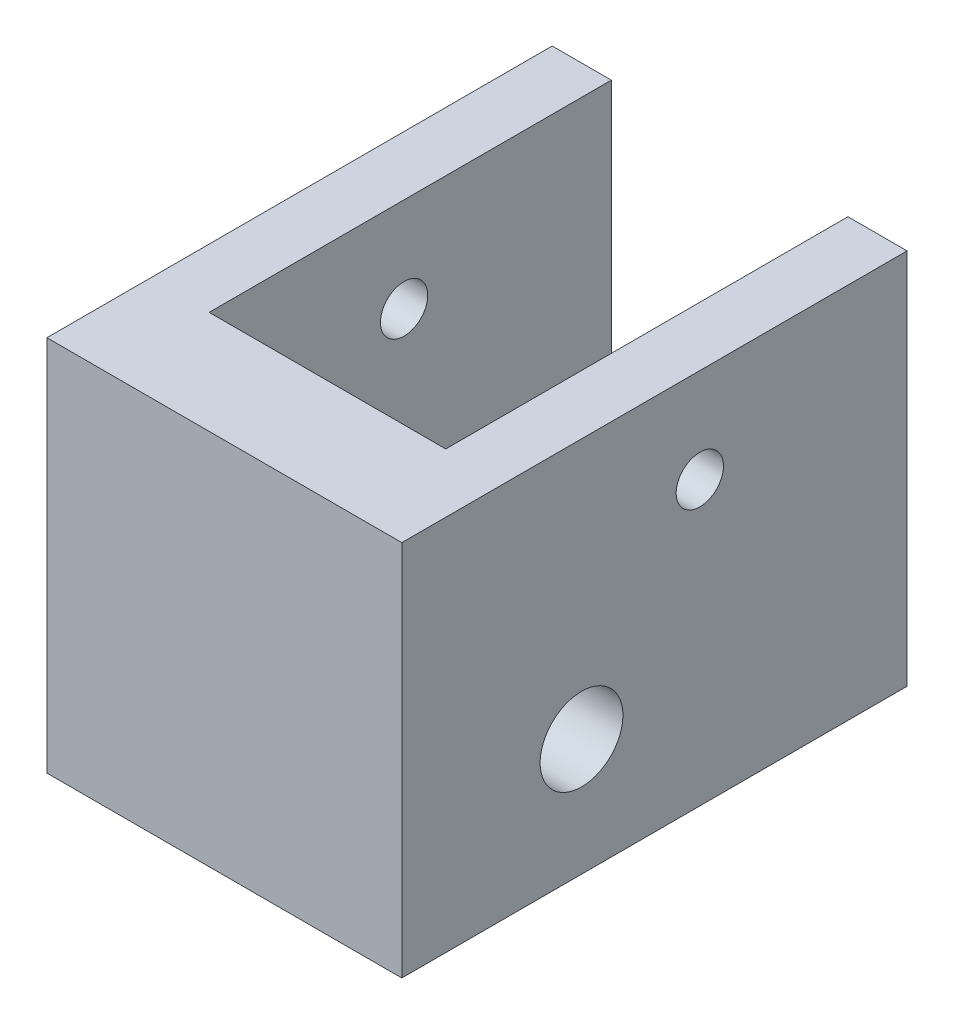
ISO-10303-21;
HEADER;
FILE_DESCRIPTION(('STEP AP214'),'2;1');
FILE_NAME('part.step','',(''),(''),'','','');
FILE_SCHEMA(('AUTOMOTIVE_DESIGN { 1 0 10303 214 1 1 1 1 }'));
ENDSEC;
DATA;
#1=APPLICATION_CONTEXT('core data for automotive mechanical design processes');
#2=APPLICATION_PROTOCOL_DEFINITION('international standard','automotive_design',2000,#1);
#3=PRODUCT_CONTEXT('',#1,'mechanical');
#4=PRODUCT('Part','Part','',(#3));
#5=PRODUCT_RELATED_PRODUCT_CATEGORY('part','',(#4));
#6=PRODUCT_DEFINITION_FORMATION('','',#4);
#7=PRODUCT_DEFINITION_CONTEXT('part definition',#1,'design');
#8=PRODUCT_DEFINITION('design','',#6,#7);
#9=PRODUCT_DEFINITION_SHAPE('','',#8);
#10=(LENGTH_UNIT() NAMED_UNIT(*) SI_UNIT(.MILLI.,.METRE.));
#11=(NAMED_UNIT(*) PLANE_ANGLE_UNIT() SI_UNIT($,.RADIAN.));
#12=(NAMED_UNIT(*) SI_UNIT($,.STERADIAN.) SOLID_ANGLE_UNIT());
#13=UNCERTAINTY_MEASURE_WITH_UNIT(LENGTH_MEASURE(1.E-05),#10,'distance_accuracy_value','');
#14=(GEOMETRIC_REPRESENTATION_CONTEXT(3) GLOBAL_UNCERTAINTY_ASSIGNED_CONTEXT((#13)) GLOBAL_UNIT_ASSIGNED_CONTEXT((#10,
#11,#12)) REPRESENTATION_CONTEXT('',''));
#15=CARTESIAN_POINT('',(0.,0.,0.));
#16=DIRECTION('',(0.,0.,1.));
#17=DIRECTION('',(1.,0.,0.));
#18=AXIS2_PLACEMENT_3D('',#15,#16,#17);
#19=CARTESIAN_POINT('',(15.,10.9905914643143,-13.7596180706659));
#20=DIRECTION('',(0.,0.,1.));
#21=DIRECTION('',(0.,-1.,0.));
#22=AXIS2_PLACEMENT_3D('',#19,#20,#21);
#23=PLANE('',#22);
#24=DIRECTION('',(-1.,0.,0.));
#25=VECTOR('',#24,1.);
#26=CARTESIAN_POINT('',(15.,10.9905914643143,-13.7596180706659));
#27=LINE('',#26,#25);
#28=CARTESIAN_POINT('',(2.5,10.9905914643143,-13.7596180706659));
#29=VERTEX_POINT('',#28);
#30=CARTESIAN_POINT('',(0.,10.9905914643143,-13.7596180706659));
#31=VERTEX_POINT('',#30);
#32=EDGE_CURVE('E45',#29,#31,#27,.T.);
#33=ORIENTED_EDGE('',*,*,#32,.F.);
#34=DIRECTION('',(0.,1.,0.));
#35=VECTOR('',#34,1.);
#36=CARTESIAN_POINT('',(2.5,-4.94780709576564,-13.7596180706659));
#37=LINE('',#36,#35);
#38=CARTESIAN_POINT('',(2.5,-4.94680709576564,-13.7596180706659));
#39=VERTEX_POINT('',#38);
#40=EDGE_CURVE('E129',#39,#29,#37,.T.);
#41=ORIENTED_EDGE('',*,*,#40,.F.);
#42=DIRECTION('',(-1.,0.,0.));
#43=VECTOR('',#42,1.);
#44=CARTESIAN_POINT('',(15.,-4.94680709576564,-13.7596180706659));
#45=LINE('',#44,#43);
#46=CARTESIAN_POINT('',(0.,-4.94680709576564,-13.7596180706659));
#47=VERTEX_POINT('',#46);
#48=EDGE_CURVE('E83',#39,#47,#45,.T.);
#49=ORIENTED_EDGE('',*,*,#48,.T.);
#50=DIRECTION('',(0.,1.,0.));
#51=VECTOR('',#50,1.);
#52=CARTESIAN_POINT('',(0.,10.9905914643143,-13.7596180706659));
#53=LINE('',#52,#51);
#54=EDGE_CURVE('E165',#47,#31,#53,.T.);
#55=ORIENTED_EDGE('',*,*,#54,.T.);
#56=EDGE_LOOP('',(#33,#41,#49,#55));
#57=FACE_BOUND('',#56,.T.);
#58=ADVANCED_FACE('F37',(#57),#23,.F.);
#59=CARTESIAN_POINT('',(15.,0.,0.));
#60=DIRECTION('',(-1.,0.,0.));
#61=DIRECTION('',(0.,0.,1.));
#62=AXIS2_PLACEMENT_3D('',#59,#60,#61);
#63=CYLINDRICAL_SURFACE('',#62,1.75);
#64=CARTESIAN_POINT('',(2.5,0.,0.));
#65=DIRECTION('',(-1.,0.,0.));
#66=DIRECTION('',(0.,0.,1.));
#67=AXIS2_PLACEMENT_3D('',#64,#65,#66);
#68=CIRCLE('',#67,1.75);
#69=CARTESIAN_POINT('',(2.5,0.,1.75));
#70=VERTEX_POINT('',#69);
#71=EDGE_CURVE('E142',#70,#70,#68,.F.);
#72=ORIENTED_EDGE('',*,*,#71,.T.);
#73=EDGE_LOOP('',(#72));
#74=FACE_BOUND('',#73,.T.);
#75=CARTESIAN_POINT('',(0.,0.,0.));
#76=DIRECTION('',(1.,0.,0.));
#77=DIRECTION('',(0.,0.,-1.));
#78=AXIS2_PLACEMENT_3D('',#75,#76,#77);
#79=CIRCLE('',#78,1.75);
#80=CARTESIAN_POINT('',(0.,0.,-1.75));
#81=VERTEX_POINT('',#80);
#82=EDGE_CURVE('E159',#81,#81,#79,.T.);
#83=ORIENTED_EDGE('',*,*,#82,.F.);
#84=EDGE_LOOP('',(#83));
#85=FACE_BOUND('',#84,.T.);
#86=ADVANCED_FACE('F200',(#74,#85),#63,.F.);
#87=CARTESIAN_POINT('',(15.,7.,-5.));
#88=DIRECTION('',(-1.,0.,0.));
#89=DIRECTION('',(0.,0.,1.));
#90=AXIS2_PLACEMENT_3D('',#87,#88,#89);
#91=CYLINDRICAL_SURFACE('',#90,1.);
#92=CARTESIAN_POINT('',(2.5,7.,-5.));
#93=DIRECTION('',(-1.,0.,0.));
#94=DIRECTION('',(0.,0.,1.));
#95=AXIS2_PLACEMENT_3D('',#92,#93,#94);
#96=CIRCLE('',#95,1.);
#97=CARTESIAN_POINT('',(2.5,7.,-4.));
#98=VERTEX_POINT('',#97);
#99=EDGE_CURVE('E135',#98,#98,#96,.F.);
#100=ORIENTED_EDGE('',*,*,#99,.T.);
#101=EDGE_LOOP('',(#100));
#102=FACE_BOUND('',#101,.T.);
#103=CARTESIAN_POINT('',(0.,7.,-5.));
#104=DIRECTION('',(1.,0.,0.));
#105=DIRECTION('',(0.,0.,-1.));
#106=AXIS2_PLACEMENT_3D('',#103,#104,#105);
#107=CIRCLE('',#106,1.);
#108=CARTESIAN_POINT('',(0.,7.,-6.));
#109=VERTEX_POINT('',#108);
#110=EDGE_CURVE('E128',#109,#109,#107,.T.);
#111=ORIENTED_EDGE('',*,*,#110,.F.);
#112=EDGE_LOOP('',(#111));
#113=FACE_BOUND('',#112,.T.);
#114=ADVANCED_FACE('F204',(#102,#113),#91,.F.);
#115=CARTESIAN_POINT('',(15.,0.,0.));
#116=DIRECTION('',(-1.,0.,0.));
#117=DIRECTION('',(0.,0.,1.));
#118=AXIS2_PLACEMENT_3D('',#115,#116,#117);
#119=PLANE('',#118);
#120=DIRECTION('',(0.,1.,0.));
#121=VECTOR('',#120,1.);
#122=CARTESIAN_POINT('',(15.,10.9905914643143,-13.7596180706659));
#123=LINE('',#122,#121);
#124=CARTESIAN_POINT('',(15.,-4.94680709576564,-13.7596180706659));
#125=VERTEX_POINT('',#124);
#126=CARTESIAN_POINT('',(15.,10.9905914643143,-13.7596180706659));
#127=VERTEX_POINT('',#126);
#128=EDGE_CURVE('E168',#125,#127,#123,.T.);
#129=ORIENTED_EDGE('',*,*,#128,.T.);
#130=DIRECTION('',(0.,0.,1.));
#131=VECTOR('',#130,1.);
#132=CARTESIAN_POINT('',(15.,10.9905914643143,-13.7596180706659));
#133=LINE('',#132,#131);
#134=CARTESIAN_POINT('',(15.,10.9905914643143,7.59707872008108));
#135=VERTEX_POINT('',#134);
#136=EDGE_CURVE('E90',#127,#135,#133,.T.);
#137=ORIENTED_EDGE('',*,*,#136,.T.);
#138=DIRECTION('',(0.,-1.,0.));
#139=VECTOR('',#138,1.);
#140=CARTESIAN_POINT('',(15.,10.9905914643143,7.59707872008108));
#141=LINE('',#140,#139);
#142=CARTESIAN_POINT('',(15.,-4.94680709576564,7.59707872008108));
#143=VERTEX_POINT('',#142);
#144=EDGE_CURVE('E172',#135,#143,#141,.T.);
#145=ORIENTED_EDGE('',*,*,#144,.T.);
#146=DIRECTION('',(0.,0.,-1.));
#147=VECTOR('',#146,1.);
#148=CARTESIAN_POINT('',(15.,-4.94680709576564,-13.7596180706659));
#149=LINE('',#148,#147);
#150=EDGE_CURVE('E61',#143,#125,#149,.T.);
#151=ORIENTED_EDGE('',*,*,#150,.T.);
#152=EDGE_LOOP('',(#129,#137,#145,#151));
#153=FACE_BOUND('',#152,.T.);
#154=CARTESIAN_POINT('',(15.,0.,0.));
#155=DIRECTION('',(1.,0.,0.));
#156=DIRECTION('',(0.,0.,-1.));
#157=AXIS2_PLACEMENT_3D('',#154,#155,#156);
#158=CIRCLE('',#157,1.75);
#159=CARTESIAN_POINT('',(15.,0.,-1.75));
#160=VERTEX_POINT('',#159);
#161=EDGE_CURVE('E162',#160,#160,#158,.T.);
#162=ORIENTED_EDGE('',*,*,#161,.F.);
#163=EDGE_LOOP('',(#162));
#164=FACE_BOUND('',#163,.T.);
#165=CARTESIAN_POINT('',(15.,7.,-5.));
#166=DIRECTION('',(1.,0.,0.));
#167=DIRECTION('',(0.,0.,-1.));
#168=AXIS2_PLACEMENT_3D('',#165,#166,#167);
#169=CIRCLE('',#168,1.);
#170=CARTESIAN_POINT('',(15.,7.,-6.));
#171=VERTEX_POINT('',#170);
#172=EDGE_CURVE('E156',#171,#171,#169,.T.);
#173=ORIENTED_EDGE('',*,*,#172,.F.);
#174=EDGE_LOOP('',(#173));
#175=FACE_BOUND('',#174,.T.);
#176=ADVANCED_FACE('F215',(#153,#164,#175),#119,.F.);
#177=CARTESIAN_POINT('',(0.,0.,0.));
#178=DIRECTION('',(-1.,0.,0.));
#179=DIRECTION('',(0.,0.,1.));
#180=AXIS2_PLACEMENT_3D('',#177,#178,#179);
#181=PLANE('',#180);
#182=ORIENTED_EDGE('',*,*,#82,.T.);
#183=EDGE_LOOP('',(#182));
#184=FACE_BOUND('',#183,.T.);
#185=ORIENTED_EDGE('',*,*,#54,.F.);
#186=DIRECTION('',(0.,0.,-1.));
#187=VECTOR('',#186,1.);
#188=CARTESIAN_POINT('',(0.,-4.94680709576564,-13.7596180706659));
#189=LINE('',#188,#187);
#190=CARTESIAN_POINT('',(0.,-4.94680709576564,7.59707872008108));
#191=VERTEX_POINT('',#190);
#192=EDGE_CURVE('E170',#191,#47,#189,.T.);
#193=ORIENTED_EDGE('',*,*,#192,.F.);
#194=DIRECTION('',(0.,-1.,0.));
#195=VECTOR('',#194,1.);
#196=CARTESIAN_POINT('',(0.,10.9905914643143,7.59707872008108));
#197=LINE('',#196,#195);
#198=CARTESIAN_POINT('',(0.,10.9905914643143,7.59707872008108));
#199=VERTEX_POINT('',#198);
#200=EDGE_CURVE('E178',#199,#191,#197,.T.);
#201=ORIENTED_EDGE('',*,*,#200,.F.);
#202=DIRECTION('',(0.,0.,1.));
#203=VECTOR('',#202,1.);
#204=CARTESIAN_POINT('',(0.,10.9905914643143,-13.7596180706659));
#205=LINE('',#204,#203);
#206=EDGE_CURVE('E176',#31,#199,#205,.T.);
#207=ORIENTED_EDGE('',*,*,#206,.F.);
#208=EDGE_LOOP('',(#185,#193,#201,#207));
#209=FACE_BOUND('',#208,.T.);
#210=ORIENTED_EDGE('',*,*,#110,.T.);
#211=EDGE_LOOP('',(#210));
#212=FACE_BOUND('',#211,.T.);
#213=ADVANCED_FACE('F196',(#184,#209,#212),#181,.T.);
#214=CARTESIAN_POINT('',(12.5,-4.94680709576564,-13.7596180706659));
#215=VERTEX_POINT('',#214);
#216=EDGE_CURVE('E181',#125,#215,#45,.T.);
#217=ORIENTED_EDGE('',*,*,#216,.T.);
#218=DIRECTION('',(0.,1.,0.));
#219=VECTOR('',#218,1.);
#220=CARTESIAN_POINT('',(12.5,-4.94780709576564,-13.7596180706659));
#221=LINE('',#220,#219);
#222=CARTESIAN_POINT('',(12.5,10.9905914643143,-13.7596180706659));
#223=VERTEX_POINT('',#222);
#224=EDGE_CURVE('E150',#215,#223,#221,.T.);
#225=ORIENTED_EDGE('',*,*,#224,.T.);
#226=EDGE_CURVE('E11',#127,#223,#27,.T.);
#227=ORIENTED_EDGE('',*,*,#226,.F.);
#228=ORIENTED_EDGE('',*,*,#128,.F.);
#229=EDGE_LOOP('',(#217,#225,#227,#228));
#230=FACE_BOUND('',#229,.T.);
#231=ADVANCED_FACE('F39',(#230),#23,.F.);
#232=CARTESIAN_POINT('',(15.,10.9905914643143,-13.7596180706659));
#233=DIRECTION('',(0.,-1.,0.));
#234=DIRECTION('',(0.,0.,-1.));
#235=AXIS2_PLACEMENT_3D('',#232,#233,#234);
#236=PLANE('',#235);
#237=DIRECTION('',(1.,0.,0.));
#238=VECTOR('',#237,1.);
#239=CARTESIAN_POINT('',(2.5,10.9905914643143,3.24038192933407));
#240=LINE('',#239,#238);
#241=CARTESIAN_POINT('',(2.5,10.9905914643143,3.24038192933407));
#242=VERTEX_POINT('',#241);
#243=CARTESIAN_POINT('',(12.5,10.9905914643143,3.24038192933407));
#244=VERTEX_POINT('',#243);
#245=EDGE_CURVE('E146',#242,#244,#240,.T.);
#246=ORIENTED_EDGE('',*,*,#245,.F.);
#247=DIRECTION('',(0.,0.,1.));
#248=VECTOR('',#247,1.);
#249=CARTESIAN_POINT('',(2.5,10.9905914643143,-13.7596180706659));
#250=LINE('',#249,#248);
#251=EDGE_CURVE('E117',#29,#242,#250,.T.);
#252=ORIENTED_EDGE('',*,*,#251,.F.);
#253=ORIENTED_EDGE('',*,*,#32,.T.);
#254=ORIENTED_EDGE('',*,*,#206,.T.);
#255=DIRECTION('',(-1.,0.,0.));
#256=VECTOR('',#255,1.);
#257=CARTESIAN_POINT('',(15.,10.9905914643143,7.59707872008108));
#258=LINE('',#257,#256);
#259=EDGE_CURVE('E186',#135,#199,#258,.T.);
#260=ORIENTED_EDGE('',*,*,#259,.F.);
#261=ORIENTED_EDGE('',*,*,#136,.F.);
#262=ORIENTED_EDGE('',*,*,#226,.T.);
#263=DIRECTION('',(0.,0.,-1.));
#264=VECTOR('',#263,1.);
#265=CARTESIAN_POINT('',(12.5,10.9905914643143,-13.7596180706659));
#266=LINE('',#265,#264);
#267=EDGE_CURVE('E122',#244,#223,#266,.T.);
#268=ORIENTED_EDGE('',*,*,#267,.F.);
#269=EDGE_LOOP('',(#246,#252,#253,#254,#260,#261,#262,#268));
#270=FACE_BOUND('',#269,.T.);
#271=ADVANCED_FACE('F193',(#270),#236,.F.);
#272=CARTESIAN_POINT('',(15.,10.9905914643143,7.59707872008108));
#273=DIRECTION('',(0.,0.,-1.));
#274=DIRECTION('',(-1.,0.,0.));
#275=AXIS2_PLACEMENT_3D('',#272,#273,#274);
#276=PLANE('',#275);
#277=ORIENTED_EDGE('',*,*,#200,.T.);
#278=DIRECTION('',(-1.,0.,0.));
#279=VECTOR('',#278,1.);
#280=CARTESIAN_POINT('',(15.,-4.94680709576564,7.59707872008108));
#281=LINE('',#280,#279);
#282=EDGE_CURVE('E184',#143,#191,#281,.T.);
#283=ORIENTED_EDGE('',*,*,#282,.F.);
#284=ORIENTED_EDGE('',*,*,#144,.F.);
#285=ORIENTED_EDGE('',*,*,#259,.T.);
#286=EDGE_LOOP('',(#277,#283,#284,#285));
#287=FACE_BOUND('',#286,.T.);
#288=ADVANCED_FACE('F214',(#287),#276,.F.);
#289=CARTESIAN_POINT('',(15.,-4.94680709576564,-13.7596180706659));
#290=DIRECTION('',(0.,1.,0.));
#291=DIRECTION('',(0.,0.,1.));
#292=AXIS2_PLACEMENT_3D('',#289,#290,#291);
#293=PLANE('',#292);
#294=ORIENTED_EDGE('',*,*,#48,.F.);
#295=DIRECTION('',(0.,0.,-1.));
#296=VECTOR('',#295,1.);
#297=CARTESIAN_POINT('',(2.5,-4.94680709576564,-13.7596180706659));
#298=LINE('',#297,#296);
#299=CARTESIAN_POINT('',(2.5,-4.94680709576564,3.24038192933407));
#300=VERTEX_POINT('',#299);
#301=EDGE_CURVE('E115',#300,#39,#298,.T.);
#302=ORIENTED_EDGE('',*,*,#301,.F.);
#303=DIRECTION('',(-1.,0.,0.));
#304=VECTOR('',#303,1.);
#305=CARTESIAN_POINT('',(2.5,-4.94680709576564,3.24038192933407));
#306=LINE('',#305,#304);
#307=CARTESIAN_POINT('',(12.5,-4.94680709576564,3.24038192933406));
#308=VERTEX_POINT('',#307);
#309=EDGE_CURVE('E125',#308,#300,#306,.T.);
#310=ORIENTED_EDGE('',*,*,#309,.F.);
#311=DIRECTION('',(0.,0.,1.));
#312=VECTOR('',#311,1.);
#313=CARTESIAN_POINT('',(12.5,-4.94680709576564,-13.7596180706659));
#314=LINE('',#313,#312);
#315=EDGE_CURVE('E52',#215,#308,#314,.T.);
#316=ORIENTED_EDGE('',*,*,#315,.F.);
#317=ORIENTED_EDGE('',*,*,#216,.F.);
#318=ORIENTED_EDGE('',*,*,#150,.F.);
#319=ORIENTED_EDGE('',*,*,#282,.T.);
#320=ORIENTED_EDGE('',*,*,#192,.T.);
#321=EDGE_LOOP('',(#294,#302,#310,#316,#317,#318,#319,#320));
#322=FACE_BOUND('',#321,.T.);
#323=ADVANCED_FACE('F131',(#322),#293,.F.);
#324=CARTESIAN_POINT('',(12.5,0.,0.));
#325=DIRECTION('',(1.,0.,0.));
#326=DIRECTION('',(0.,0.,-1.));
#327=AXIS2_PLACEMENT_3D('',#324,#325,#326);
#328=CIRCLE('',#327,1.75);
#329=CARTESIAN_POINT('',(12.5,0.,-1.75));
#330=VERTEX_POINT('',#329);
#331=EDGE_CURVE('E141',#330,#330,#328,.F.);
#332=ORIENTED_EDGE('',*,*,#331,.T.);
#333=EDGE_LOOP('',(#332));
#334=FACE_BOUND('',#333,.T.);
#335=ORIENTED_EDGE('',*,*,#161,.T.);
#336=EDGE_LOOP('',(#335));
#337=FACE_BOUND('',#336,.T.);
#338=ADVANCED_FACE('F207',(#334,#337),#63,.F.);
#339=CARTESIAN_POINT('',(12.5,7.,-5.));
#340=DIRECTION('',(1.,0.,0.));
#341=DIRECTION('',(0.,0.,-1.));
#342=AXIS2_PLACEMENT_3D('',#339,#340,#341);
#343=CIRCLE('',#342,1.);
#344=CARTESIAN_POINT('',(12.5,7.,-6.));
#345=VERTEX_POINT('',#344);
#346=EDGE_CURVE('E132',#345,#345,#343,.F.);
#347=ORIENTED_EDGE('',*,*,#346,.T.);
#348=EDGE_LOOP('',(#347));
#349=FACE_BOUND('',#348,.T.);
#350=ORIENTED_EDGE('',*,*,#172,.T.);
#351=EDGE_LOOP('',(#350));
#352=FACE_BOUND('',#351,.T.);
#353=ADVANCED_FACE('F232',(#349,#352),#91,.F.);
#354=CARTESIAN_POINT('',(2.5,-4.94780709576564,-13.7596180706659));
#355=DIRECTION('',(-1.,0.,0.));
#356=DIRECTION('',(0.,0.,1.));
#357=AXIS2_PLACEMENT_3D('',#354,#355,#356);
#358=PLANE('',#357);
#359=ORIENTED_EDGE('',*,*,#99,.F.);
#360=EDGE_LOOP('',(#359));
#361=FACE_BOUND('',#360,.T.);
#362=ORIENTED_EDGE('',*,*,#71,.F.);
#363=EDGE_LOOP('',(#362));
#364=FACE_BOUND('',#363,.T.);
#365=ORIENTED_EDGE('',*,*,#301,.T.);
#366=ORIENTED_EDGE('',*,*,#40,.T.);
#367=ORIENTED_EDGE('',*,*,#251,.T.);
#368=DIRECTION('',(0.,1.,0.));
#369=VECTOR('',#368,1.);
#370=CARTESIAN_POINT('',(2.5,-4.94780709576564,3.24038192933407));
#371=LINE('',#370,#369);
#372=EDGE_CURVE('E111',#300,#242,#371,.T.);
#373=ORIENTED_EDGE('',*,*,#372,.F.);
#374=EDGE_LOOP('',(#365,#366,#367,#373));
#375=FACE_BOUND('',#374,.T.);
#376=ADVANCED_FACE('F113',(#361,#364,#375),#358,.F.);
#377=CARTESIAN_POINT('',(12.5,-4.94780709576564,-13.7596180706659));
#378=DIRECTION('',(1.,0.,0.));
#379=DIRECTION('',(0.,0.,-1.));
#380=AXIS2_PLACEMENT_3D('',#377,#378,#379);
#381=PLANE('',#380);
#382=ORIENTED_EDGE('',*,*,#346,.F.);
#383=EDGE_LOOP('',(#382));
#384=FACE_BOUND('',#383,.T.);
#385=ORIENTED_EDGE('',*,*,#331,.F.);
#386=EDGE_LOOP('',(#385));
#387=FACE_BOUND('',#386,.T.);
#388=ORIENTED_EDGE('',*,*,#315,.T.);
#389=DIRECTION('',(0.,1.,0.));
#390=VECTOR('',#389,1.);
#391=CARTESIAN_POINT('',(12.5,-4.94780709576564,3.24038192933407));
#392=LINE('',#391,#390);
#393=EDGE_CURVE('E121',#308,#244,#392,.T.);
#394=ORIENTED_EDGE('',*,*,#393,.T.);
#395=ORIENTED_EDGE('',*,*,#267,.T.);
#396=ORIENTED_EDGE('',*,*,#224,.F.);
#397=EDGE_LOOP('',(#388,#394,#395,#396));
#398=FACE_BOUND('',#397,.T.);
#399=ADVANCED_FACE('F223',(#384,#387,#398),#381,.F.);
#400=CARTESIAN_POINT('',(2.5,-4.94780709576564,3.24038192933407));
#401=DIRECTION('',(0.,0.,1.));
#402=DIRECTION('',(1.,0.,0.));
#403=AXIS2_PLACEMENT_3D('',#400,#401,#402);
#404=PLANE('',#403);
#405=ORIENTED_EDGE('',*,*,#309,.T.);
#406=ORIENTED_EDGE('',*,*,#372,.T.);
#407=ORIENTED_EDGE('',*,*,#245,.T.);
#408=ORIENTED_EDGE('',*,*,#393,.F.);
#409=EDGE_LOOP('',(#405,#406,#407,#408));
#410=FACE_BOUND('',#409,.T.);
#411=ADVANCED_FACE('F126',(#410),#404,.F.);
#412=CLOSED_SHELL('',(#58,#86,#114,#176,#213,#231,#271,#288,#323,#338,#353,#376,#399,#411));
#413=MANIFOLD_SOLID_BREP('B2',#412);
#414=ADVANCED_BREP_SHAPE_REPRESENTATION('',(#18,#413),#14);
#415=SHAPE_DEFINITION_REPRESENTATION(#9,#414);
ENDSEC;
END-ISO-10303-21;
